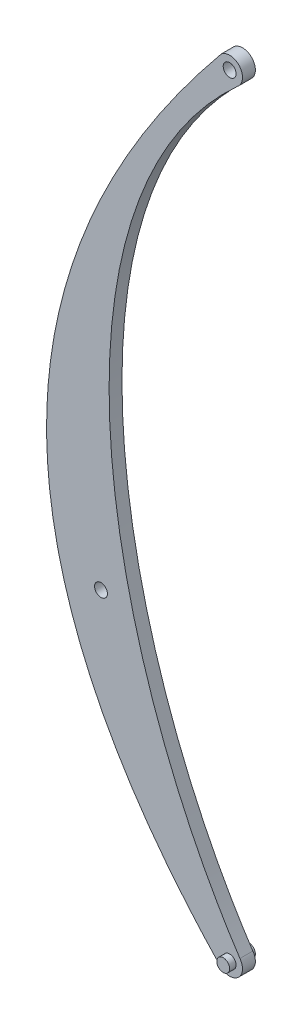
ISO-10303-21;
HEADER;
FILE_DESCRIPTION(('STEP AP214'),'2;1');
FILE_NAME('part.step','',(''),(''),'','','');
FILE_SCHEMA(('AUTOMOTIVE_DESIGN { 1 0 10303 214 1 1 1 1 }'));
ENDSEC;
DATA;
#1=APPLICATION_CONTEXT('core data for automotive mechanical design processes');
#2=APPLICATION_PROTOCOL_DEFINITION('international standard','automotive_design',2000,#1);
#3=PRODUCT_CONTEXT('',#1,'mechanical');
#4=PRODUCT('Part','Part','',(#3));
#5=PRODUCT_RELATED_PRODUCT_CATEGORY('part','',(#4));
#6=PRODUCT_DEFINITION_FORMATION('','',#4);
#7=PRODUCT_DEFINITION_CONTEXT('part definition',#1,'design');
#8=PRODUCT_DEFINITION('design','',#6,#7);
#9=PRODUCT_DEFINITION_SHAPE('','',#8);
#10=(LENGTH_UNIT() NAMED_UNIT(*) SI_UNIT(.MILLI.,.METRE.));
#11=(NAMED_UNIT(*) PLANE_ANGLE_UNIT() SI_UNIT($,.RADIAN.));
#12=(NAMED_UNIT(*) SI_UNIT($,.STERADIAN.) SOLID_ANGLE_UNIT());
#13=UNCERTAINTY_MEASURE_WITH_UNIT(LENGTH_MEASURE(1.E-05),#10,'distance_accuracy_value','');
#14=(GEOMETRIC_REPRESENTATION_CONTEXT(3) GLOBAL_UNCERTAINTY_ASSIGNED_CONTEXT((#13)) GLOBAL_UNIT_ASSIGNED_CONTEXT((#10,
#11,#12)) REPRESENTATION_CONTEXT('',''));
#15=CARTESIAN_POINT('',(0.,0.,0.));
#16=DIRECTION('',(0.,0.,1.));
#17=DIRECTION('',(1.,0.,0.));
#18=AXIS2_PLACEMENT_3D('',#15,#16,#17);
#19=CARTESIAN_POINT('',(6.05462440411538,592.041261197583,5.));
#20=CARTESIAN_POINT('',(-154.861931166089,445.129888811564,5.));
#21=CARTESIAN_POINT('',(-96.296929142944,163.306236231955,5.));
#22=CARTESIAN_POINT('',(8.0284255753068,5.96191100082512,5.));
#23=B_SPLINE_CURVE_WITH_KNOTS('',3,(#19,#20,#21,#22),.UNSPECIFIED.,.F.,.F.,(4,4),(0.,1.),.UNSPECIFIED.);
#24=DIRECTION('',(0.,0.,-1.));
#25=VECTOR('',#24,1.);
#26=SURFACE_OF_LINEAR_EXTRUSION('',#23,#25);
#27=DIRECTION('',(0.,0.,-1.));
#28=VECTOR('',#27,1.);
#29=CARTESIAN_POINT('',(8.0284255753068,5.96191100082513,5.));
#30=LINE('',#29,#28);
#31=CARTESIAN_POINT('',(8.0284255753068,5.96191100082513,5.));
#32=VERTEX_POINT('',#31);
#33=CARTESIAN_POINT('',(8.0284255753068,5.96191100082513,-5.));
#34=VERTEX_POINT('',#33);
#35=EDGE_CURVE('E73',#32,#34,#30,.T.);
#36=ORIENTED_EDGE('',*,*,#35,.T.);
#37=CARTESIAN_POINT('',(6.05462440411538,592.041261197583,-5.));
#38=CARTESIAN_POINT('',(-154.861931166089,445.129888811564,-5.));
#39=CARTESIAN_POINT('',(-96.296929142944,163.306236231955,-5.));
#40=CARTESIAN_POINT('',(8.0284255753068,5.96191100082512,-5.));
#41=B_SPLINE_CURVE_WITH_KNOTS('',3,(#37,#38,#39,#40),.UNSPECIFIED.,.F.,.F.,(4,4),(0.,1.),.UNSPECIFIED.);
#42=CARTESIAN_POINT('',(6.05462440411546,592.041261197583,-5.));
#43=VERTEX_POINT('',#42);
#44=EDGE_CURVE('E75',#43,#34,#41,.T.);
#45=ORIENTED_EDGE('',*,*,#44,.F.);
#46=DIRECTION('',(0.,0.,-1.));
#47=VECTOR('',#46,1.);
#48=CARTESIAN_POINT('',(6.05462440411546,592.041261197583,5.));
#49=LINE('',#48,#47);
#50=CARTESIAN_POINT('',(6.05462440411546,592.041261197583,5.));
#51=VERTEX_POINT('',#50);
#52=EDGE_CURVE('E11',#51,#43,#49,.T.);
#53=ORIENTED_EDGE('',*,*,#52,.F.);
#54=EDGE_CURVE('E77',#51,#32,#23,.T.);
#55=ORIENTED_EDGE('',*,*,#54,.T.);
#56=EDGE_LOOP('',(#36,#45,#53,#55));
#57=FACE_BOUND('',#56,.T.);
#58=ADVANCED_FACE('F35',(#57),#26,.T.);
#59=CARTESIAN_POINT('',(0.,600.,5.));
#60=DIRECTION('',(0.,0.,-1.));
#61=DIRECTION('',(-1.,0.,0.));
#62=AXIS2_PLACEMENT_3D('',#59,#60,#61);
#63=CYLINDRICAL_SURFACE('',#62,10.);
#64=ORIENTED_EDGE('',*,*,#52,.T.);
#65=CARTESIAN_POINT('',(0.,600.,-5.));
#66=DIRECTION('',(0.,0.,1.));
#67=DIRECTION('',(1.,0.,0.));
#68=AXIS2_PLACEMENT_3D('',#65,#66,#67);
#69=CIRCLE('',#68,10.);
#70=CARTESIAN_POINT('',(-6.42536659564945,607.662549452468,-5.));
#71=VERTEX_POINT('',#70);
#72=EDGE_CURVE('E90',#43,#71,#69,.T.);
#73=ORIENTED_EDGE('',*,*,#72,.T.);
#74=DIRECTION('',(0.,0.,-1.));
#75=VECTOR('',#74,1.);
#76=CARTESIAN_POINT('',(-6.42536659564945,607.662549452468,5.));
#77=LINE('',#76,#75);
#78=CARTESIAN_POINT('',(-6.42536659564945,607.662549452468,5.));
#79=VERTEX_POINT('',#78);
#80=EDGE_CURVE('E43',#79,#71,#77,.T.);
#81=ORIENTED_EDGE('',*,*,#80,.F.);
#82=CARTESIAN_POINT('',(0.,600.,5.));
#83=DIRECTION('',(0.,0.,1.));
#84=DIRECTION('',(1.,0.,0.));
#85=AXIS2_PLACEMENT_3D('',#82,#83,#84);
#86=CIRCLE('',#85,10.);
#87=EDGE_CURVE('E121',#51,#79,#86,.T.);
#88=ORIENTED_EDGE('',*,*,#87,.F.);
#89=EDGE_LOOP('',(#64,#73,#81,#88));
#90=FACE_BOUND('',#89,.T.);
#91=ADVANCED_FACE('F128',(#90),#63,.T.);
#92=CARTESIAN_POINT('',(-6.42536659564948,607.662549452468,5.));
#93=CARTESIAN_POINT('',(-277.843168437771,277.304372569073,5.));
#94=CARTESIAN_POINT('',(-7.07496458026032,-7.06716889483066,5.));
#95=B_SPLINE_CURVE_WITH_KNOTS('',2,(#92,#93,#94),.UNSPECIFIED.,.F.,.F.,(3,3),(0.,1.),.UNSPECIFIED.);
#96=DIRECTION('',(0.,0.,-1.));
#97=VECTOR('',#96,1.);
#98=SURFACE_OF_LINEAR_EXTRUSION('',#95,#97);
#99=ORIENTED_EDGE('',*,*,#80,.T.);
#100=CARTESIAN_POINT('',(-6.42536659564948,607.662549452468,-5.));
#101=CARTESIAN_POINT('',(-277.843168437771,277.304372569073,-5.));
#102=CARTESIAN_POINT('',(-7.07496458026032,-7.06716889483066,-5.));
#103=B_SPLINE_CURVE_WITH_KNOTS('',2,(#100,#101,#102),.UNSPECIFIED.,.F.,.F.,(3,3),(0.,1.),.UNSPECIFIED.);
#104=CARTESIAN_POINT('',(-7.07496458026032,-7.06716889483066,-5.));
#105=VERTEX_POINT('',#104);
#106=EDGE_CURVE('E95',#71,#105,#103,.T.);
#107=ORIENTED_EDGE('',*,*,#106,.T.);
#108=DIRECTION('',(0.,0.,-1.));
#109=VECTOR('',#108,1.);
#110=CARTESIAN_POINT('',(-7.07496458026032,-7.06716889483066,5.));
#111=LINE('',#110,#109);
#112=CARTESIAN_POINT('',(-7.07496458026032,-7.06716889483066,5.));
#113=VERTEX_POINT('',#112);
#114=EDGE_CURVE('E79',#113,#105,#111,.T.);
#115=ORIENTED_EDGE('',*,*,#114,.F.);
#116=EDGE_CURVE('E137',#79,#113,#95,.T.);
#117=ORIENTED_EDGE('',*,*,#116,.F.);
#118=EDGE_LOOP('',(#99,#107,#115,#117));
#119=FACE_BOUND('',#118,.T.);
#120=ADVANCED_FACE('F131',(#119),#98,.F.);
#121=CARTESIAN_POINT('',(0.,0.,5.));
#122=DIRECTION('',(0.,0.,-1.));
#123=DIRECTION('',(-1.,0.,0.));
#124=AXIS2_PLACEMENT_3D('',#121,#122,#123);
#125=CYLINDRICAL_SURFACE('',#124,10.);
#126=ORIENTED_EDGE('',*,*,#114,.T.);
#127=CARTESIAN_POINT('',(0.,0.,-5.));
#128=DIRECTION('',(0.,0.,1.));
#129=DIRECTION('',(1.,0.,0.));
#130=AXIS2_PLACEMENT_3D('',#127,#128,#129);
#131=CIRCLE('',#130,10.);
#132=EDGE_CURVE('E87',#105,#34,#131,.T.);
#133=ORIENTED_EDGE('',*,*,#132,.T.);
#134=ORIENTED_EDGE('',*,*,#35,.F.);
#135=CARTESIAN_POINT('',(0.,0.,5.));
#136=DIRECTION('',(0.,0.,1.));
#137=DIRECTION('',(1.,0.,0.));
#138=AXIS2_PLACEMENT_3D('',#135,#136,#137);
#139=CIRCLE('',#138,10.);
#140=EDGE_CURVE('E50',#113,#32,#139,.T.);
#141=ORIENTED_EDGE('',*,*,#140,.F.);
#142=EDGE_LOOP('',(#126,#133,#134,#141));
#143=FACE_BOUND('',#142,.T.);
#144=ADVANCED_FACE('F93',(#143),#125,.T.);
#145=CARTESIAN_POINT('',(-100.,200.,5.));
#146=DIRECTION('',(0.,0.,-1.));
#147=DIRECTION('',(-1.,0.,0.));
#148=AXIS2_PLACEMENT_3D('',#145,#146,#147);
#149=CYLINDRICAL_SURFACE('',#148,5.00000000000001);
#150=CARTESIAN_POINT('',(-100.,200.,5.));
#151=DIRECTION('',(0.,0.,1.));
#152=DIRECTION('',(1.,0.,0.));
#153=AXIS2_PLACEMENT_3D('',#150,#151,#152);
#154=CIRCLE('',#153,5.00000000000001);
#155=CARTESIAN_POINT('',(-95.,200.,5.));
#156=VERTEX_POINT('',#155);
#157=EDGE_CURVE('E114',#156,#156,#154,.T.);
#158=ORIENTED_EDGE('',*,*,#157,.T.);
#159=EDGE_LOOP('',(#158));
#160=FACE_BOUND('',#159,.T.);
#161=CARTESIAN_POINT('',(-100.,200.,-5.));
#162=DIRECTION('',(0.,0.,1.));
#163=DIRECTION('',(1.,0.,0.));
#164=AXIS2_PLACEMENT_3D('',#161,#162,#163);
#165=CIRCLE('',#164,5.00000000000001);
#166=CARTESIAN_POINT('',(-95.,200.,-5.));
#167=VERTEX_POINT('',#166);
#168=EDGE_CURVE('E91',#167,#167,#165,.T.);
#169=ORIENTED_EDGE('',*,*,#168,.F.);
#170=EDGE_LOOP('',(#169));
#171=FACE_BOUND('',#170,.T.);
#172=ADVANCED_FACE('F37',(#160,#171),#149,.F.);
#173=CARTESIAN_POINT('',(0.,600.,5.));
#174=DIRECTION('',(0.,0.,-1.));
#175=DIRECTION('',(-1.,0.,0.));
#176=AXIS2_PLACEMENT_3D('',#173,#174,#175);
#177=CYLINDRICAL_SURFACE('',#176,5.);
#178=CARTESIAN_POINT('',(0.,600.,5.));
#179=DIRECTION('',(0.,0.,1.));
#180=DIRECTION('',(1.,0.,0.));
#181=AXIS2_PLACEMENT_3D('',#178,#179,#180);
#182=CIRCLE('',#181,5.);
#183=CARTESIAN_POINT('',(5.,600.,5.));
#184=VERTEX_POINT('',#183);
#185=EDGE_CURVE('E80',#184,#184,#182,.T.);
#186=ORIENTED_EDGE('',*,*,#185,.T.);
#187=EDGE_LOOP('',(#186));
#188=FACE_BOUND('',#187,.T.);
#189=CARTESIAN_POINT('',(0.,600.,-5.));
#190=DIRECTION('',(0.,0.,1.));
#191=DIRECTION('',(1.,0.,0.));
#192=AXIS2_PLACEMENT_3D('',#189,#190,#191);
#193=CIRCLE('',#192,5.);
#194=CARTESIAN_POINT('',(5.,600.,-5.));
#195=VERTEX_POINT('',#194);
#196=EDGE_CURVE('E108',#195,#195,#193,.T.);
#197=ORIENTED_EDGE('',*,*,#196,.F.);
#198=EDGE_LOOP('',(#197));
#199=FACE_BOUND('',#198,.T.);
#200=ADVANCED_FACE('F158',(#188,#199),#177,.F.);
#201=CARTESIAN_POINT('',(0.,0.,5.));
#202=DIRECTION('',(0.,0.,1.));
#203=DIRECTION('',(1.,0.,0.));
#204=AXIS2_PLACEMENT_3D('',#201,#202,#203);
#205=PLANE('',#204);
#206=ORIENTED_EDGE('',*,*,#157,.F.);
#207=EDGE_LOOP('',(#206));
#208=FACE_BOUND('',#207,.T.);
#209=ORIENTED_EDGE('',*,*,#54,.F.);
#210=ORIENTED_EDGE('',*,*,#87,.T.);
#211=ORIENTED_EDGE('',*,*,#116,.T.);
#212=ORIENTED_EDGE('',*,*,#140,.T.);
#213=EDGE_LOOP('',(#209,#210,#211,#212));
#214=FACE_BOUND('',#213,.T.);
#215=CARTESIAN_POINT('',(0.,0.,5.));
#216=DIRECTION('',(0.,0.,1.));
#217=DIRECTION('',(1.,0.,0.));
#218=AXIS2_PLACEMENT_3D('',#215,#216,#217);
#219=CIRCLE('',#218,5.);
#220=CARTESIAN_POINT('',(5.,0.,5.));
#221=VERTEX_POINT('',#220);
#222=EDGE_CURVE('E146',#221,#221,#219,.T.);
#223=ORIENTED_EDGE('',*,*,#222,.F.);
#224=EDGE_LOOP('',(#223));
#225=FACE_BOUND('',#224,.T.);
#226=ORIENTED_EDGE('',*,*,#185,.F.);
#227=EDGE_LOOP('',(#226));
#228=FACE_BOUND('',#227,.T.);
#229=ADVANCED_FACE('F154',(#208,#214,#225,#228),#205,.T.);
#230=CARTESIAN_POINT('',(0.,0.,10.));
#231=DIRECTION('',(0.,0.,-1.));
#232=DIRECTION('',(-1.,0.,0.));
#233=AXIS2_PLACEMENT_3D('',#230,#231,#232);
#234=CYLINDRICAL_SURFACE('',#233,5.);
#235=ORIENTED_EDGE('',*,*,#222,.T.);
#236=EDGE_LOOP('',(#235));
#237=FACE_BOUND('',#236,.T.);
#238=CARTESIAN_POINT('',(0.,0.,10.));
#239=DIRECTION('',(0.,0.,1.));
#240=DIRECTION('',(1.,0.,0.));
#241=AXIS2_PLACEMENT_3D('',#238,#239,#240);
#242=CIRCLE('',#241,5.);
#243=CARTESIAN_POINT('',(5.,0.,10.));
#244=VERTEX_POINT('',#243);
#245=EDGE_CURVE('E111',#244,#244,#242,.T.);
#246=ORIENTED_EDGE('',*,*,#245,.F.);
#247=EDGE_LOOP('',(#246));
#248=FACE_BOUND('',#247,.T.);
#249=ADVANCED_FACE('F157',(#237,#248),#234,.T.);
#250=CARTESIAN_POINT('',(0.,0.,10.));
#251=DIRECTION('',(0.,0.,1.));
#252=DIRECTION('',(1.,0.,0.));
#253=AXIS2_PLACEMENT_3D('',#250,#251,#252);
#254=PLANE('',#253);
#255=ORIENTED_EDGE('',*,*,#245,.T.);
#256=EDGE_LOOP('',(#255));
#257=FACE_BOUND('',#256,.T.);
#258=ADVANCED_FACE('F171',(#257),#254,.T.);
#259=CARTESIAN_POINT('',(0.,0.,-5.));
#260=DIRECTION('',(0.,0.,-1.));
#261=DIRECTION('',(1.,0.,0.));
#262=AXIS2_PLACEMENT_3D('',#259,#260,#261);
#263=PLANE('',#262);
#264=ORIENTED_EDGE('',*,*,#168,.T.);
#265=EDGE_LOOP('',(#264));
#266=FACE_BOUND('',#265,.T.);
#267=ORIENTED_EDGE('',*,*,#44,.T.);
#268=ORIENTED_EDGE('',*,*,#132,.F.);
#269=ORIENTED_EDGE('',*,*,#106,.F.);
#270=ORIENTED_EDGE('',*,*,#72,.F.);
#271=EDGE_LOOP('',(#267,#268,#269,#270));
#272=FACE_BOUND('',#271,.T.);
#273=CARTESIAN_POINT('',(0.,0.,-5.));
#274=DIRECTION('',(0.,0.,-1.));
#275=DIRECTION('',(-1.,0.,0.));
#276=AXIS2_PLACEMENT_3D('',#273,#274,#275);
#277=CIRCLE('',#276,5.);
#278=CARTESIAN_POINT('',(-5.,0.,-5.));
#279=VERTEX_POINT('',#278);
#280=EDGE_CURVE('E271',#279,#279,#277,.T.);
#281=ORIENTED_EDGE('',*,*,#280,.F.);
#282=EDGE_LOOP('',(#281));
#283=FACE_BOUND('',#282,.T.);
#284=ORIENTED_EDGE('',*,*,#196,.T.);
#285=EDGE_LOOP('',(#284));
#286=FACE_BOUND('',#285,.T.);
#287=ADVANCED_FACE('F84',(#266,#272,#283,#286),#263,.T.);
#288=CARTESIAN_POINT('',(0.,0.,-10.));
#289=DIRECTION('',(0.,0.,1.));
#290=DIRECTION('',(1.,0.,0.));
#291=AXIS2_PLACEMENT_3D('',#288,#289,#290);
#292=CYLINDRICAL_SURFACE('',#291,5.);
#293=ORIENTED_EDGE('',*,*,#280,.T.);
#294=EDGE_LOOP('',(#293));
#295=FACE_BOUND('',#294,.T.);
#296=CARTESIAN_POINT('',(0.,0.,-10.));
#297=DIRECTION('',(0.,0.,1.));
#298=DIRECTION('',(1.,0.,0.));
#299=AXIS2_PLACEMENT_3D('',#296,#297,#298);
#300=CIRCLE('',#299,5.);
#301=CARTESIAN_POINT('',(5.,0.,-10.));
#302=VERTEX_POINT('',#301);
#303=EDGE_CURVE('E269',#302,#302,#300,.T.);
#304=ORIENTED_EDGE('',*,*,#303,.T.);
#305=EDGE_LOOP('',(#304));
#306=FACE_BOUND('',#305,.T.);
#307=ADVANCED_FACE('F170',(#295,#306),#292,.T.);
#308=CARTESIAN_POINT('',(0.,0.,-10.));
#309=DIRECTION('',(0.,0.,-1.));
#310=DIRECTION('',(1.,0.,0.));
#311=AXIS2_PLACEMENT_3D('',#308,#309,#310);
#312=PLANE('',#311);
#313=ORIENTED_EDGE('',*,*,#303,.F.);
#314=EDGE_LOOP('',(#313));
#315=FACE_BOUND('',#314,.T.);
#316=ADVANCED_FACE('F178',(#315),#312,.T.);
#317=CLOSED_SHELL('',(#58,#91,#120,#144,#172,#200,#229,#249,#258,#287,#307,#316));
#318=MANIFOLD_SOLID_BREP('B2',#317);
#319=ADVANCED_BREP_SHAPE_REPRESENTATION('',(#18,#318),#14);
#320=SHAPE_DEFINITION_REPRESENTATION(#9,#319);
ENDSEC;
END-ISO-10303-21;
